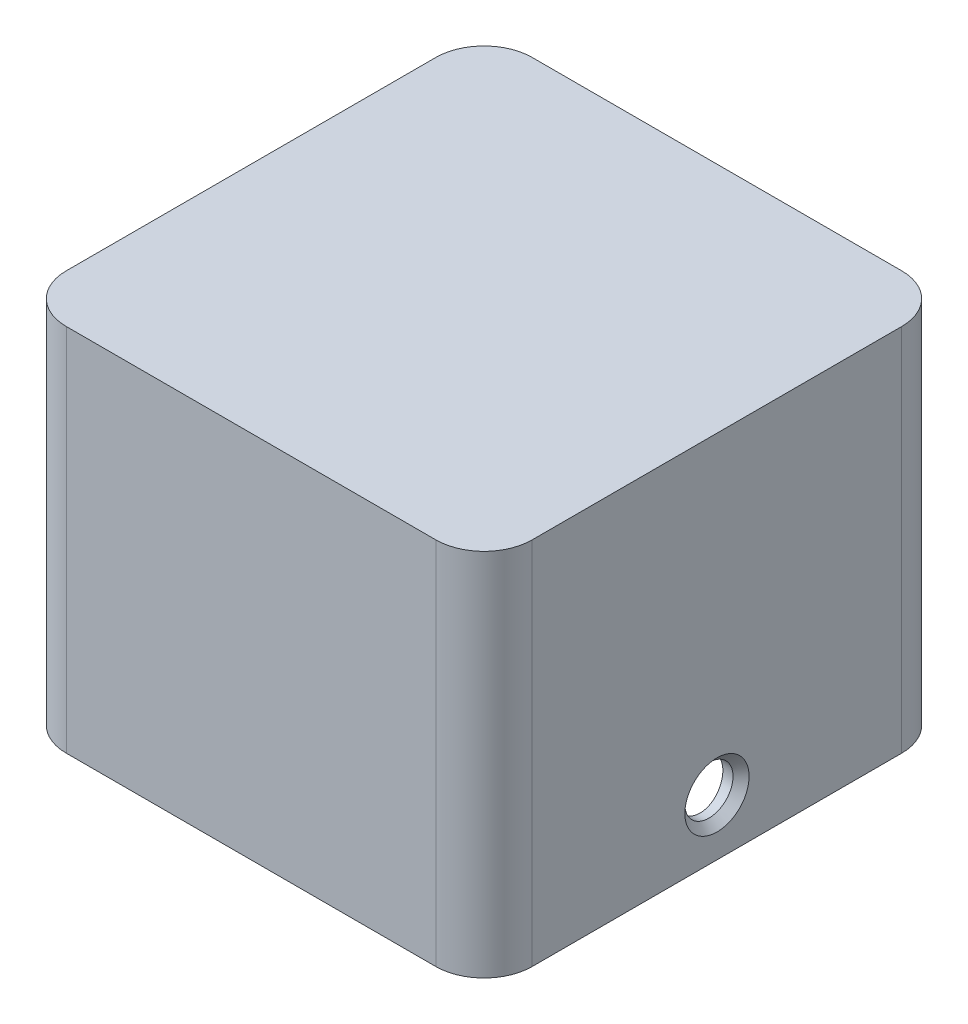
ISO-10303-21;
HEADER;
FILE_DESCRIPTION(('STEP AP214'),'2;1');
FILE_NAME('part.step','',(''),(''),'','','');
FILE_SCHEMA(('AUTOMOTIVE_DESIGN { 1 0 10303 214 1 1 1 1 }'));
ENDSEC;
DATA;
#1=APPLICATION_CONTEXT('core data for automotive mechanical design processes');
#2=APPLICATION_PROTOCOL_DEFINITION('international standard','automotive_design',2000,#1);
#3=PRODUCT_CONTEXT('',#1,'mechanical');
#4=PRODUCT('Part','Part','',(#3));
#5=PRODUCT_RELATED_PRODUCT_CATEGORY('part','',(#4));
#6=PRODUCT_DEFINITION_FORMATION('','',#4);
#7=PRODUCT_DEFINITION_CONTEXT('part definition',#1,'design');
#8=PRODUCT_DEFINITION('design','',#6,#7);
#9=PRODUCT_DEFINITION_SHAPE('','',#8);
#10=(LENGTH_UNIT() NAMED_UNIT(*) SI_UNIT(.MILLI.,.METRE.));
#11=(NAMED_UNIT(*) PLANE_ANGLE_UNIT() SI_UNIT($,.RADIAN.));
#12=(NAMED_UNIT(*) SI_UNIT($,.STERADIAN.) SOLID_ANGLE_UNIT());
#13=UNCERTAINTY_MEASURE_WITH_UNIT(LENGTH_MEASURE(1.E-05),#10,'distance_accuracy_value','');
#14=(GEOMETRIC_REPRESENTATION_CONTEXT(3) GLOBAL_UNCERTAINTY_ASSIGNED_CONTEXT((#13)) GLOBAL_UNIT_ASSIGNED_CONTEXT((#10,
#11,#12)) REPRESENTATION_CONTEXT('',''));
#15=CARTESIAN_POINT('',(0.,0.,0.));
#16=DIRECTION('',(0.,0.,1.));
#17=DIRECTION('',(1.,0.,0.));
#18=AXIS2_PLACEMENT_3D('',#15,#16,#17);
#19=CARTESIAN_POINT('',(0.,23.,0.));
#20=DIRECTION('',(1.,0.,0.));
#21=DIRECTION('',(0.,0.,-1.));
#22=AXIS2_PLACEMENT_3D('',#19,#20,#21);
#23=PLANE('',#22);
#24=CARTESIAN_POINT('',(0.,3.5,-14.5));
#25=DIRECTION('',(1.,0.,0.));
#26=DIRECTION('',(0.,0.,-1.));
#27=AXIS2_PLACEMENT_3D('',#24,#25,#26);
#28=CIRCLE('',#27,2.00000000000003);
#29=CARTESIAN_POINT('',(0.,3.5,-16.5));
#30=VERTEX_POINT('',#29);
#31=EDGE_CURVE('E11',#30,#30,#28,.T.);
#32=ORIENTED_EDGE('',*,*,#31,.T.);
#33=EDGE_LOOP('',(#32));
#34=FACE_BOUND('',#33,.T.);
#35=DIRECTION('',(0.,0.,1.));
#36=VECTOR('',#35,1.);
#37=CARTESIAN_POINT('',(0.,23.,0.));
#38=LINE('',#37,#36);
#39=CARTESIAN_POINT('',(0.,23.,-26.));
#40=VERTEX_POINT('',#39);
#41=CARTESIAN_POINT('',(0.,23.,-3.));
#42=VERTEX_POINT('',#41);
#43=EDGE_CURVE('E123',#40,#42,#38,.T.);
#44=ORIENTED_EDGE('',*,*,#43,.F.);
#45=DIRECTION('',(0.,-1.,0.));
#46=VECTOR('',#45,1.);
#47=CARTESIAN_POINT('',(0.,23.,-26.));
#48=LINE('',#47,#46);
#49=CARTESIAN_POINT('',(0.,0.,-26.));
#50=VERTEX_POINT('',#49);
#51=EDGE_CURVE('E108',#40,#50,#48,.T.);
#52=ORIENTED_EDGE('',*,*,#51,.T.);
#53=DIRECTION('',(0.,0.,1.));
#54=VECTOR('',#53,1.);
#55=CARTESIAN_POINT('',(0.,0.,0.));
#56=LINE('',#55,#54);
#57=CARTESIAN_POINT('',(0.,0.,-3.));
#58=VERTEX_POINT('',#57);
#59=EDGE_CURVE('E120',#50,#58,#56,.T.);
#60=ORIENTED_EDGE('',*,*,#59,.T.);
#61=DIRECTION('',(0.,-1.,0.));
#62=VECTOR('',#61,1.);
#63=CARTESIAN_POINT('',(0.,23.,-3.));
#64=LINE('',#63,#62);
#65=EDGE_CURVE('E125',#58,#42,#64,.F.);
#66=ORIENTED_EDGE('',*,*,#65,.T.);
#67=EDGE_LOOP('',(#44,#52,#60,#66));
#68=FACE_BOUND('',#67,.T.);
#69=ADVANCED_FACE('F36',(#34,#68),#23,.F.);
#70=CARTESIAN_POINT('',(0.,23.,0.));
#71=DIRECTION('',(0.,0.,-1.));
#72=DIRECTION('',(-1.,0.,0.));
#73=AXIS2_PLACEMENT_3D('',#70,#71,#72);
#74=PLANE('',#73);
#75=DIRECTION('',(1.,0.,0.));
#76=VECTOR('',#75,1.);
#77=CARTESIAN_POINT('',(0.,0.,0.));
#78=LINE('',#77,#76);
#79=CARTESIAN_POINT('',(3.,0.,0.));
#80=VERTEX_POINT('',#79);
#81=CARTESIAN_POINT('',(26.,0.,0.));
#82=VERTEX_POINT('',#81);
#83=EDGE_CURVE('E129',#80,#82,#78,.T.);
#84=ORIENTED_EDGE('',*,*,#83,.T.);
#85=DIRECTION('',(0.,-1.,0.));
#86=VECTOR('',#85,1.);
#87=CARTESIAN_POINT('',(26.,23.,0.));
#88=LINE('',#87,#86);
#89=CARTESIAN_POINT('',(26.,23.,0.));
#90=VERTEX_POINT('',#89);
#91=EDGE_CURVE('E167',#82,#90,#88,.F.);
#92=ORIENTED_EDGE('',*,*,#91,.T.);
#93=DIRECTION('',(1.,0.,0.));
#94=VECTOR('',#93,1.);
#95=CARTESIAN_POINT('',(0.,23.,0.));
#96=LINE('',#95,#94);
#97=CARTESIAN_POINT('',(3.,23.,0.));
#98=VERTEX_POINT('',#97);
#99=EDGE_CURVE('E305',#98,#90,#96,.T.);
#100=ORIENTED_EDGE('',*,*,#99,.F.);
#101=DIRECTION('',(0.,-1.,0.));
#102=VECTOR('',#101,1.);
#103=CARTESIAN_POINT('',(3.,23.,0.));
#104=LINE('',#103,#102);
#105=EDGE_CURVE('E164',#98,#80,#104,.T.);
#106=ORIENTED_EDGE('',*,*,#105,.T.);
#107=EDGE_LOOP('',(#84,#92,#100,#106));
#108=FACE_BOUND('',#107,.T.);
#109=ADVANCED_FACE('F243',(#108),#74,.F.);
#110=CARTESIAN_POINT('',(29.,23.,0.));
#111=DIRECTION('',(-1.,0.,0.));
#112=DIRECTION('',(0.,0.,1.));
#113=AXIS2_PLACEMENT_3D('',#110,#111,#112);
#114=PLANE('',#113);
#115=CARTESIAN_POINT('',(29.,3.5,-14.5));
#116=DIRECTION('',(-1.,0.,0.));
#117=DIRECTION('',(0.,0.,1.));
#118=AXIS2_PLACEMENT_3D('',#115,#116,#117);
#119=CIRCLE('',#118,1.99999999999998);
#120=CARTESIAN_POINT('',(29.,3.5,-12.5));
#121=VERTEX_POINT('',#120);
#122=EDGE_CURVE('E169',#121,#121,#119,.T.);
#123=ORIENTED_EDGE('',*,*,#122,.T.);
#124=EDGE_LOOP('',(#123));
#125=FACE_BOUND('',#124,.T.);
#126=DIRECTION('',(0.,0.,-1.));
#127=VECTOR('',#126,1.);
#128=CARTESIAN_POINT('',(29.,0.,0.));
#129=LINE('',#128,#127);
#130=CARTESIAN_POINT('',(29.,0.,-3.));
#131=VERTEX_POINT('',#130);
#132=CARTESIAN_POINT('',(29.,0.,-26.));
#133=VERTEX_POINT('',#132);
#134=EDGE_CURVE('E133',#131,#133,#129,.T.);
#135=ORIENTED_EDGE('',*,*,#134,.T.);
#136=DIRECTION('',(0.,-1.,0.));
#137=VECTOR('',#136,1.);
#138=CARTESIAN_POINT('',(29.,23.,-26.));
#139=LINE('',#138,#137);
#140=CARTESIAN_POINT('',(29.,23.,-26.));
#141=VERTEX_POINT('',#140);
#142=EDGE_CURVE('E52',#133,#141,#139,.F.);
#143=ORIENTED_EDGE('',*,*,#142,.T.);
#144=DIRECTION('',(0.,0.,-1.));
#145=VECTOR('',#144,1.);
#146=CARTESIAN_POINT('',(29.,23.,0.));
#147=LINE('',#146,#145);
#148=CARTESIAN_POINT('',(29.,23.,-3.));
#149=VERTEX_POINT('',#148);
#150=EDGE_CURVE('E306',#149,#141,#147,.T.);
#151=ORIENTED_EDGE('',*,*,#150,.F.);
#152=DIRECTION('',(0.,-1.,0.));
#153=VECTOR('',#152,1.);
#154=CARTESIAN_POINT('',(29.,23.,-3.));
#155=LINE('',#154,#153);
#156=EDGE_CURVE('E160',#149,#131,#155,.T.);
#157=ORIENTED_EDGE('',*,*,#156,.T.);
#158=EDGE_LOOP('',(#135,#143,#151,#157));
#159=FACE_BOUND('',#158,.T.);
#160=ADVANCED_FACE('F250',(#125,#159),#114,.F.);
#161=CARTESIAN_POINT('',(0.,23.,-29.));
#162=DIRECTION('',(0.,0.,1.));
#163=DIRECTION('',(1.,0.,0.));
#164=AXIS2_PLACEMENT_3D('',#161,#162,#163);
#165=PLANE('',#164);
#166=DIRECTION('',(-1.,0.,0.));
#167=VECTOR('',#166,1.);
#168=CARTESIAN_POINT('',(0.,0.,-29.));
#169=LINE('',#168,#167);
#170=CARTESIAN_POINT('',(26.,0.,-29.));
#171=VERTEX_POINT('',#170);
#172=CARTESIAN_POINT('',(3.,0.,-29.));
#173=VERTEX_POINT('',#172);
#174=EDGE_CURVE('E143',#171,#173,#169,.T.);
#175=ORIENTED_EDGE('',*,*,#174,.T.);
#176=DIRECTION('',(0.,-1.,0.));
#177=VECTOR('',#176,1.);
#178=CARTESIAN_POINT('',(3.,23.,-29.));
#179=LINE('',#178,#177);
#180=CARTESIAN_POINT('',(3.,23.,-29.));
#181=VERTEX_POINT('',#180);
#182=EDGE_CURVE('E109',#173,#181,#179,.F.);
#183=ORIENTED_EDGE('',*,*,#182,.T.);
#184=DIRECTION('',(-1.,0.,0.));
#185=VECTOR('',#184,1.);
#186=CARTESIAN_POINT('',(0.,23.,-29.));
#187=LINE('',#186,#185);
#188=CARTESIAN_POINT('',(26.,23.,-29.));
#189=VERTEX_POINT('',#188);
#190=EDGE_CURVE('E139',#189,#181,#187,.T.);
#191=ORIENTED_EDGE('',*,*,#190,.F.);
#192=DIRECTION('',(0.,-1.,0.));
#193=VECTOR('',#192,1.);
#194=CARTESIAN_POINT('',(26.,23.,-29.));
#195=LINE('',#194,#193);
#196=EDGE_CURVE('E114',#189,#171,#195,.T.);
#197=ORIENTED_EDGE('',*,*,#196,.T.);
#198=EDGE_LOOP('',(#175,#183,#191,#197));
#199=FACE_BOUND('',#198,.T.);
#200=ADVANCED_FACE('F313',(#199),#165,.F.);
#201=CARTESIAN_POINT('',(0.,23.,0.));
#202=DIRECTION('',(0.,-1.,0.));
#203=DIRECTION('',(0.,0.,-1.));
#204=AXIS2_PLACEMENT_3D('',#201,#202,#203);
#205=PLANE('',#204);
#206=ORIENTED_EDGE('',*,*,#190,.T.);
#207=CARTESIAN_POINT('',(3.,23.,-26.));
#208=DIRECTION('',(0.,-1.,0.));
#209=DIRECTION('',(0.,0.,-1.));
#210=AXIS2_PLACEMENT_3D('',#207,#208,#209);
#211=CIRCLE('',#210,3.);
#212=EDGE_CURVE('E158',#181,#40,#211,.F.);
#213=ORIENTED_EDGE('',*,*,#212,.T.);
#214=ORIENTED_EDGE('',*,*,#43,.T.);
#215=CARTESIAN_POINT('',(3.,23.,-3.));
#216=DIRECTION('',(0.,-1.,0.));
#217=DIRECTION('',(0.,0.,-1.));
#218=AXIS2_PLACEMENT_3D('',#215,#216,#217);
#219=CIRCLE('',#218,3.);
#220=EDGE_CURVE('E153',#42,#98,#219,.F.);
#221=ORIENTED_EDGE('',*,*,#220,.T.);
#222=ORIENTED_EDGE('',*,*,#99,.T.);
#223=CARTESIAN_POINT('',(26.,23.,-3.));
#224=DIRECTION('',(0.,-1.,0.));
#225=DIRECTION('',(0.,0.,-1.));
#226=AXIS2_PLACEMENT_3D('',#223,#224,#225);
#227=CIRCLE('',#226,3.);
#228=EDGE_CURVE('E59',#90,#149,#227,.F.);
#229=ORIENTED_EDGE('',*,*,#228,.T.);
#230=ORIENTED_EDGE('',*,*,#150,.T.);
#231=CARTESIAN_POINT('',(26.,23.,-26.));
#232=DIRECTION('',(0.,-1.,0.));
#233=DIRECTION('',(0.,0.,-1.));
#234=AXIS2_PLACEMENT_3D('',#231,#232,#233);
#235=CIRCLE('',#234,3.);
#236=EDGE_CURVE('E156',#141,#189,#235,.F.);
#237=ORIENTED_EDGE('',*,*,#236,.T.);
#238=EDGE_LOOP('',(#206,#213,#214,#221,#222,#229,#230,#237));
#239=FACE_BOUND('',#238,.T.);
#240=ADVANCED_FACE('F310',(#239),#205,.F.);
#241=CARTESIAN_POINT('',(0.,0.,0.));
#242=DIRECTION('',(0.,-1.,0.));
#243=DIRECTION('',(0.,0.,-1.));
#244=AXIS2_PLACEMENT_3D('',#241,#242,#243);
#245=PLANE('',#244);
#246=CARTESIAN_POINT('',(2.99999999999997,0.,-26.));
#247=DIRECTION('',(0.,-1.,0.));
#248=DIRECTION('',(0.,0.,1.));
#249=AXIS2_PLACEMENT_3D('',#246,#247,#248);
#250=CIRCLE('',#249,0.85);
#251=CARTESIAN_POINT('',(2.99999999999997,0.,-25.15));
#252=VERTEX_POINT('',#251);
#253=EDGE_CURVE('E471',#252,#252,#250,.T.);
#254=ORIENTED_EDGE('',*,*,#253,.F.);
#255=EDGE_LOOP('',(#254));
#256=FACE_BOUND('',#255,.T.);
#257=CARTESIAN_POINT('',(26.,0.,-26.));
#258=DIRECTION('',(0.,-1.,0.));
#259=DIRECTION('',(0.,0.,-1.));
#260=AXIS2_PLACEMENT_3D('',#257,#258,#259);
#261=CIRCLE('',#260,0.85);
#262=CARTESIAN_POINT('',(26.,0.,-26.85));
#263=VERTEX_POINT('',#262);
#264=EDGE_CURVE('E475',#263,#263,#261,.T.);
#265=ORIENTED_EDGE('',*,*,#264,.F.);
#266=EDGE_LOOP('',(#265));
#267=FACE_BOUND('',#266,.T.);
#268=CARTESIAN_POINT('',(26.,0.,-3.));
#269=DIRECTION('',(0.,-1.,0.));
#270=DIRECTION('',(0.,0.,1.));
#271=AXIS2_PLACEMENT_3D('',#268,#269,#270);
#272=CIRCLE('',#271,0.85);
#273=CARTESIAN_POINT('',(26.,0.,-2.15));
#274=VERTEX_POINT('',#273);
#275=EDGE_CURVE('E479',#274,#274,#272,.T.);
#276=ORIENTED_EDGE('',*,*,#275,.F.);
#277=EDGE_LOOP('',(#276));
#278=FACE_BOUND('',#277,.T.);
#279=CARTESIAN_POINT('',(2.99999999999999,0.,-3.));
#280=DIRECTION('',(0.,-1.,0.));
#281=DIRECTION('',(0.,0.,-1.));
#282=AXIS2_PLACEMENT_3D('',#279,#280,#281);
#283=CIRCLE('',#282,0.85);
#284=CARTESIAN_POINT('',(2.99999999999999,0.,-3.85));
#285=VERTEX_POINT('',#284);
#286=EDGE_CURVE('E482',#285,#285,#283,.T.);
#287=ORIENTED_EDGE('',*,*,#286,.F.);
#288=EDGE_LOOP('',(#287));
#289=FACE_BOUND('',#288,.T.);
#290=CARTESIAN_POINT('',(14.5,0.,-14.5));
#291=DIRECTION('',(0.,-1.,0.));
#292=DIRECTION('',(0.,0.,-1.));
#293=AXIS2_PLACEMENT_3D('',#290,#291,#292);
#294=CIRCLE('',#293,13.45);
#295=CARTESIAN_POINT('',(14.5,0.,-27.95));
#296=VERTEX_POINT('',#295);
#297=EDGE_CURVE('E136',#296,#296,#294,.T.);
#298=ORIENTED_EDGE('',*,*,#297,.F.);
#299=EDGE_LOOP('',(#298));
#300=FACE_BOUND('',#299,.T.);
#301=ORIENTED_EDGE('',*,*,#59,.F.);
#302=CARTESIAN_POINT('',(3.,0.,-26.));
#303=DIRECTION('',(0.,-1.,0.));
#304=DIRECTION('',(0.,0.,-1.));
#305=AXIS2_PLACEMENT_3D('',#302,#303,#304);
#306=CIRCLE('',#305,3.);
#307=EDGE_CURVE('E104',#50,#173,#306,.T.);
#308=ORIENTED_EDGE('',*,*,#307,.T.);
#309=ORIENTED_EDGE('',*,*,#174,.F.);
#310=CARTESIAN_POINT('',(26.,0.,-26.));
#311=DIRECTION('',(0.,-1.,0.));
#312=DIRECTION('',(0.,0.,-1.));
#313=AXIS2_PLACEMENT_3D('',#310,#311,#312);
#314=CIRCLE('',#313,3.);
#315=EDGE_CURVE('E115',#171,#133,#314,.T.);
#316=ORIENTED_EDGE('',*,*,#315,.T.);
#317=ORIENTED_EDGE('',*,*,#134,.F.);
#318=CARTESIAN_POINT('',(26.,0.,-3.));
#319=DIRECTION('',(0.,-1.,0.));
#320=DIRECTION('',(0.,0.,-1.));
#321=AXIS2_PLACEMENT_3D('',#318,#319,#320);
#322=CIRCLE('',#321,3.);
#323=EDGE_CURVE('E147',#131,#82,#322,.T.);
#324=ORIENTED_EDGE('',*,*,#323,.T.);
#325=ORIENTED_EDGE('',*,*,#83,.F.);
#326=CARTESIAN_POINT('',(3.,0.,-3.));
#327=DIRECTION('',(0.,-1.,0.));
#328=DIRECTION('',(0.,0.,-1.));
#329=AXIS2_PLACEMENT_3D('',#326,#327,#328);
#330=CIRCLE('',#329,3.);
#331=EDGE_CURVE('E124',#80,#58,#330,.T.);
#332=ORIENTED_EDGE('',*,*,#331,.T.);
#333=EDGE_LOOP('',(#301,#308,#309,#316,#317,#324,#325,#332));
#334=FACE_BOUND('',#333,.T.);
#335=ADVANCED_FACE('F127',(#256,#267,#278,#289,#300,#334),#245,.T.);
#336=CARTESIAN_POINT('',(3.,23.,-26.));
#337=DIRECTION('',(0.,-1.,0.));
#338=DIRECTION('',(0.,0.,-1.));
#339=AXIS2_PLACEMENT_3D('',#336,#337,#338);
#340=CYLINDRICAL_SURFACE('',#339,3.);
#341=ORIENTED_EDGE('',*,*,#212,.F.);
#342=ORIENTED_EDGE('',*,*,#182,.F.);
#343=ORIENTED_EDGE('',*,*,#307,.F.);
#344=ORIENTED_EDGE('',*,*,#51,.F.);
#345=EDGE_LOOP('',(#341,#342,#343,#344));
#346=FACE_BOUND('',#345,.T.);
#347=ADVANCED_FACE('F107',(#346),#340,.T.);
#348=CARTESIAN_POINT('',(26.,23.,-26.));
#349=DIRECTION('',(0.,-1.,0.));
#350=DIRECTION('',(0.,0.,-1.));
#351=AXIS2_PLACEMENT_3D('',#348,#349,#350);
#352=CYLINDRICAL_SURFACE('',#351,3.);
#353=ORIENTED_EDGE('',*,*,#236,.F.);
#354=ORIENTED_EDGE('',*,*,#142,.F.);
#355=ORIENTED_EDGE('',*,*,#315,.F.);
#356=ORIENTED_EDGE('',*,*,#196,.F.);
#357=EDGE_LOOP('',(#353,#354,#355,#356));
#358=FACE_BOUND('',#357,.T.);
#359=ADVANCED_FACE('F257',(#358),#352,.T.);
#360=CARTESIAN_POINT('',(26.,23.,-3.));
#361=DIRECTION('',(0.,-1.,0.));
#362=DIRECTION('',(0.,0.,-1.));
#363=AXIS2_PLACEMENT_3D('',#360,#361,#362);
#364=CYLINDRICAL_SURFACE('',#363,3.);
#365=ORIENTED_EDGE('',*,*,#228,.F.);
#366=ORIENTED_EDGE('',*,*,#91,.F.);
#367=ORIENTED_EDGE('',*,*,#323,.F.);
#368=ORIENTED_EDGE('',*,*,#156,.F.);
#369=EDGE_LOOP('',(#365,#366,#367,#368));
#370=FACE_BOUND('',#369,.T.);
#371=ADVANCED_FACE('F260',(#370),#364,.T.);
#372=CARTESIAN_POINT('',(3.,23.,-3.));
#373=DIRECTION('',(0.,-1.,0.));
#374=DIRECTION('',(0.,0.,-1.));
#375=AXIS2_PLACEMENT_3D('',#372,#373,#374);
#376=CYLINDRICAL_SURFACE('',#375,3.);
#377=ORIENTED_EDGE('',*,*,#220,.F.);
#378=ORIENTED_EDGE('',*,*,#65,.F.);
#379=ORIENTED_EDGE('',*,*,#331,.F.);
#380=ORIENTED_EDGE('',*,*,#105,.F.);
#381=EDGE_LOOP('',(#377,#378,#379,#380));
#382=FACE_BOUND('',#381,.T.);
#383=ADVANCED_FACE('F238',(#382),#376,.T.);
#384=CARTESIAN_POINT('',(14.5,6.75,-14.5));
#385=DIRECTION('',(0.,-1.,0.));
#386=DIRECTION('',(0.,0.,-1.));
#387=AXIS2_PLACEMENT_3D('',#384,#385,#386);
#388=CYLINDRICAL_SURFACE('',#387,13.45);
#389=CARTESIAN_POINT('',(27.8660951665024,3.5,-13.));
#390=CARTESIAN_POINT('',(27.8660962556716,3.41602591520711,-13.0000036100501));
#391=CARTESIAN_POINT('',(27.8668950681178,3.33199762222411,-13.0070754161476));
#392=CARTESIAN_POINT('',(27.8700032342052,3.16627456327549,-13.0351772613165));
#393=CARTESIAN_POINT('',(27.8723142151043,3.08458241020455,-13.0562223375072));
#394=CARTESIAN_POINT('',(27.8781817725248,2.92595531941418,-13.1116469413439));
#395=CARTESIAN_POINT('',(27.8817375546714,2.84901738452409,-13.1460179664836));
#396=CARTESIAN_POINT('',(27.8896930997676,2.70201771553143,-13.2271016178089));
#397=CARTESIAN_POINT('',(27.8940927052054,2.63195470180851,-13.273811941298));
#398=CARTESIAN_POINT('',(27.9032622764335,2.50036380999346,-13.378473006224));
#399=CARTESIAN_POINT('',(27.908033652545,2.43887117373274,-13.4364679384079));
#400=CARTESIAN_POINT('',(27.9173964069745,2.32647049147204,-13.5619571499876));
#401=CARTESIAN_POINT('',(27.9219877767424,2.27556294776426,-13.6294518799206));
#402=CARTESIAN_POINT('',(27.9304873814741,2.18565345074478,-13.7722434334907));
#403=CARTESIAN_POINT('',(27.9343937954266,2.14668303404182,-13.8475602319443));
#404=CARTESIAN_POINT('',(27.9410679186574,2.08195586653981,-14.0037197601065));
#405=CARTESIAN_POINT('',(27.9438356619622,2.05619872088766,-14.0845623246064));
#406=CARTESIAN_POINT('',(27.9479106776437,2.0187335582705,-14.2491202184332));
#407=CARTESIAN_POINT('',(27.9492240037729,2.00696729155712,-14.3328221336484));
#408=CARTESIAN_POINT('',(27.950262836992,1.99763752643912,-14.501022205433));
#409=CARTESIAN_POINT('',(27.9499883945001,2.00007357705156,-14.5855203366341));
#410=CARTESIAN_POINT('',(27.9478875420891,2.01903227480298,-14.7525184389088));
#411=CARTESIAN_POINT('',(27.9460680335036,2.03549228234181,-14.8350256202149));
#412=CARTESIAN_POINT('',(27.9410893407858,2.08193392522201,-14.99609911842));
#413=CARTESIAN_POINT('',(27.937930135677,2.11191577228384,-15.0746653735918));
#414=CARTESIAN_POINT('',(27.9306152425109,2.18461780133527,-15.2258227329515));
#415=CARTESIAN_POINT('',(27.926457410679,2.22736543664336,-15.2984005249886));
#416=CARTESIAN_POINT('',(27.9176112208746,2.32436564590732,-15.4353755008842));
#417=CARTESIAN_POINT('',(27.9129228435336,2.37861863994925,-15.4997723859024));
#418=CARTESIAN_POINT('',(27.9035109582735,2.49744118703849,-15.6189249371154));
#419=CARTESIAN_POINT('',(27.898787398021,2.56206527567696,-15.6736262290863));
#420=CARTESIAN_POINT('',(27.889862855698,2.69960724948402,-15.7714131550996));
#421=CARTESIAN_POINT('',(27.8856618747221,2.77252515202614,-15.8144987648092));
#422=CARTESIAN_POINT('',(27.8782579776847,2.92462955314788,-15.887832476574));
#423=CARTESIAN_POINT('',(27.8750553563697,3.00381789431744,-15.9180767884352));
#424=CARTESIAN_POINT('',(27.8700167583711,3.16619270153424,-15.9648241098007));
#425=CARTESIAN_POINT('',(27.8681807296285,3.24937901515406,-15.9813276427496));
#426=CARTESIAN_POINT('',(27.8660924589792,3.41690981870056,-16.0000540942826));
#427=CARTESIAN_POINT('',(27.8658317590934,3.50124568252797,-16.0023532778589));
#428=CARTESIAN_POINT('',(27.8669013251177,3.66910142726318,-15.9928064611521));
#429=CARTESIAN_POINT('',(27.8682315641763,3.7526213219187,-15.9809606996034));
#430=CARTESIAN_POINT('',(27.8723254212207,3.91624930188173,-15.943524235506));
#431=CARTESIAN_POINT('',(27.8750852387458,3.99636582684342,-15.9179699699243));
#432=CARTESIAN_POINT('',(27.8817242136658,4.1511759214391,-15.8538792207745));
#433=CARTESIAN_POINT('',(27.8856034027029,4.22586933769865,-15.8153423702112));
#434=CARTESIAN_POINT('',(27.8940644224462,4.368059449502,-15.7261908572952));
#435=CARTESIAN_POINT('',(27.8986491508274,4.43552442591199,-15.6755258846254));
#436=CARTESIAN_POINT('',(27.9079953593078,4.56102006107922,-15.5636279983157));
#437=CARTESIAN_POINT('',(27.9127568448563,4.61905042867212,-15.5023947586453));
#438=CARTESIAN_POINT('',(27.9219458047437,4.72429470589365,-15.3707666652624));
#439=CARTESIAN_POINT('',(27.9263716775964,4.77145870570593,-15.300331778213));
#440=CARTESIAN_POINT('',(27.9343671603499,4.85328717109279,-15.1524961820907));
#441=CARTESIAN_POINT('',(27.9379367844298,4.88795184365352,-15.0750955883948));
#442=CARTESIAN_POINT('',(27.9438103972672,4.94371401267998,-14.9156962733691));
#443=CARTESIAN_POINT('',(27.946117143688,4.96484108765735,-14.8337080051765));
#444=CARTESIAN_POINT('',(27.9492164720001,4.99302474746474,-14.6673206381736));
#445=CARTESIAN_POINT('',(27.9500091075699,5.00008183110813,-14.5829216249373));
#446=CARTESIAN_POINT('',(27.9499907817542,4.99991717740147,-14.4145974943264));
#447=CARTESIAN_POINT('',(27.9491884960316,4.99277269030454,-14.3306722898377));
#448=CARTESIAN_POINT('',(27.9460876342648,4.96457039506634,-14.1652226859761));
#449=CARTESIAN_POINT('',(27.9437890579076,4.94351258401346,-14.0836982871057));
#450=CARTESIAN_POINT('',(27.9379529408912,4.888104073,-13.9253692692376));
#451=CARTESIAN_POINT('',(27.93441567042,4.85375627172305,-13.8485636252609));
#452=CARTESIAN_POINT('',(27.9264953279038,4.77275084928282,-13.7017949213762));
#453=CARTESIAN_POINT('',(27.9221122542234,4.7260932043181,-13.631831874699));
#454=CARTESIAN_POINT('',(27.9129620682991,4.62150426766657,-13.5003388229468));
#455=CARTESIAN_POINT('',(27.9081930713257,4.56351541547494,-13.4388547306411));
#456=CARTESIAN_POINT('',(27.8988241587579,4.43802718190453,-13.326457991274));
#457=CARTESIAN_POINT('',(27.8942242837583,4.37052553569526,-13.2755478688519));
#458=CARTESIAN_POINT('',(27.8856992081795,4.22769292779193,-13.1856142420761));
#459=CARTESIAN_POINT('',(27.8817761440985,4.15233833545035,-13.1466280894153));
#460=CARTESIAN_POINT('',(27.8750740858902,3.99615381482368,-13.0819163712524));
#461=CARTESIAN_POINT('',(27.8722938219585,3.91533008046754,-13.0561760797602));
#462=CARTESIAN_POINT('',(27.8688820679911,3.77838763905925,-13.0249950884898));
#463=CARTESIAN_POINT('',(27.8678420348224,3.7231396618881,-13.0156350267193));
#464=CARTESIAN_POINT('',(27.8664482229491,3.61193581723235,-13.0031362964944));
#465=CARTESIAN_POINT('',(27.8660944404256,3.5559799536888,-12.999997593419));
#466=CARTESIAN_POINT('',(27.8660951665024,3.5,-13.));
#467=B_SPLINE_CURVE_WITH_KNOTS('',3,(#389,#390,#391,#392,#393,#394,#395,#396,#397,#398,#399,
#400,#401,#402,#403,#404,#405,#406,#407,#408,#409,#410,#411,#412,#413,#414,#415,#416,#417,#418,
#419,#420,#421,#422,#423,#424,#425,#426,#427,#428,#429,#430,#431,#432,#433,#434,#435,#436,#437,
#438,#439,#440,#441,#442,#443,#444,#445,#446,#447,#448,#449,#450,#451,#452,#453,#454,#455,#456,
#457,#458,#459,#460,#461,#462,#463,#464,#465,#466),.UNSPECIFIED.,.T.,.F.,(4,2,2,2,2,2,2,2,2,2,2,
2,2,2,2,2,2,2,2,2,2,2,2,2,2,2,2,2,2,2,2,2,2,2,2,2,2,2,4),(0.,0.251717794108654,
0.503706910431048,0.755535511168764,1.00731715010269,1.26010536972087,1.51290558210957,
1.76636801708078,2.01982287737524,2.27221876483798,2.52460663771978,2.77587306606575,
3.02714342879453,3.27895809786446,3.5307819628278,3.78397624288727,4.03717105333689,
4.29044054404573,4.54370038620428,4.79559925324007,5.04749386885657,5.2987222464763,
5.54995772648247,5.80225402371237,6.05455810565811,6.30799890528084,6.5614355077859,
6.81431646729545,7.06718846143729,7.31868870791811,7.57018900703013,7.82163448223285,
8.07308044361619,8.32583856630901,8.57865696829071,8.8322593959441,9.08557927049847,
9.25338376527555,9.42118732623846),.UNSPECIFIED.);
#468=CARTESIAN_POINT('',(27.8660951665024,3.5,-13.));
#469=VERTEX_POINT('',#468);
#470=EDGE_CURVE('E178',#469,#469,#467,.T.);
#471=ORIENTED_EDGE('',*,*,#470,.T.);
#472=EDGE_LOOP('',(#471));
#473=FACE_BOUND('',#472,.T.);
#474=CARTESIAN_POINT('',(1.13390483349755,3.5,-13.));
#475=CARTESIAN_POINT('',(1.13390374432836,3.58397408479289,-13.0000036100501));
#476=CARTESIAN_POINT('',(1.13310493188218,3.66800237777589,-13.0070754161476));
#477=CARTESIAN_POINT('',(1.1299967657948,3.83372543672451,-13.0351772613165));
#478=CARTESIAN_POINT('',(1.1276857848957,3.91541758979545,-13.0562223375072));
#479=CARTESIAN_POINT('',(1.12181822747522,4.07404468058582,-13.1116469413439));
#480=CARTESIAN_POINT('',(1.11826244532862,4.15098261547591,-13.1460179664836));
#481=CARTESIAN_POINT('',(1.11030690023236,4.29798228446857,-13.2271016178089));
#482=CARTESIAN_POINT('',(1.10590729479458,4.36804529819149,-13.273811941298));
#483=CARTESIAN_POINT('',(1.09673772356646,4.49963619000654,-13.378473006224));
#484=CARTESIAN_POINT('',(1.09196634745504,4.56112882626726,-13.4364679384079));
#485=CARTESIAN_POINT('',(1.08260359302551,4.67352950852796,-13.5619571499876));
#486=CARTESIAN_POINT('',(1.07801222325759,4.72443705223574,-13.6294518799206));
#487=CARTESIAN_POINT('',(1.06951261852587,4.81434654925522,-13.7722434334907));
#488=CARTESIAN_POINT('',(1.06560620457341,4.85331696595818,-13.8475602319443));
#489=CARTESIAN_POINT('',(1.0589320813426,4.91804413346019,-14.0037197601065));
#490=CARTESIAN_POINT('',(1.05616433803777,4.94380127911234,-14.0845623246064));
#491=CARTESIAN_POINT('',(1.05208932235631,4.9812664417295,-14.2491202184332));
#492=CARTESIAN_POINT('',(1.05077599622708,4.99303270844288,-14.3328221336484));
#493=CARTESIAN_POINT('',(1.04973716300802,5.00236247356088,-14.501022205433));
#494=CARTESIAN_POINT('',(1.05001160549988,4.99992642294844,-14.5855203366341));
#495=CARTESIAN_POINT('',(1.05211245791092,4.98096772519703,-14.7525184389088));
#496=CARTESIAN_POINT('',(1.05393196649641,4.96450771765819,-14.8350256202149));
#497=CARTESIAN_POINT('',(1.0589106592142,4.91806607477799,-14.99609911842));
#498=CARTESIAN_POINT('',(1.06206986432298,4.88808422771616,-15.0746653735918));
#499=CARTESIAN_POINT('',(1.06938475748908,4.81538219866473,-15.2258227329515));
#500=CARTESIAN_POINT('',(1.07354258932099,4.77263456335664,-15.2984005249886));
#501=CARTESIAN_POINT('',(1.08238877912541,4.67563435409268,-15.4353755008842));
#502=CARTESIAN_POINT('',(1.08707715646639,4.62138136005075,-15.4997723859024));
#503=CARTESIAN_POINT('',(1.09648904172654,4.50255881296151,-15.6189249371154));
#504=CARTESIAN_POINT('',(1.10121260197896,4.43793472432304,-15.6736262290863));
#505=CARTESIAN_POINT('',(1.110137144302,4.30039275051598,-15.7714131550996));
#506=CARTESIAN_POINT('',(1.11433812527791,4.22747484797386,-15.8144987648092));
#507=CARTESIAN_POINT('',(1.12174202231531,4.07537044685212,-15.887832476574));
#508=CARTESIAN_POINT('',(1.12494464363032,3.99618210568256,-15.9180767884352));
#509=CARTESIAN_POINT('',(1.12998324162889,3.83380729846576,-15.9648241098007));
#510=CARTESIAN_POINT('',(1.13181927037149,3.75062098484594,-15.9813276427496));
#511=CARTESIAN_POINT('',(1.13390754102084,3.58309018129944,-16.0000540942826));
#512=CARTESIAN_POINT('',(1.13416824090656,3.49875431747203,-16.0023532778589));
#513=CARTESIAN_POINT('',(1.13309867488227,3.33089857273682,-15.9928064611521));
#514=CARTESIAN_POINT('',(1.1317684358237,3.2473786780813,-15.9809606996034));
#515=CARTESIAN_POINT('',(1.12767457877933,3.08375069811828,-15.943524235506));
#516=CARTESIAN_POINT('',(1.12491476125416,3.00363417315658,-15.9179699699243));
#517=CARTESIAN_POINT('',(1.11827578633418,2.8488240785609,-15.8538792207745));
#518=CARTESIAN_POINT('',(1.11439659729713,2.77413066230135,-15.8153423702112));
#519=CARTESIAN_POINT('',(1.10593557755375,2.631940550498,-15.7261908572952));
#520=CARTESIAN_POINT('',(1.10135084917257,2.56447557408802,-15.6755258846254));
#521=CARTESIAN_POINT('',(1.09200464069221,2.43897993892078,-15.5636279983157));
#522=CARTESIAN_POINT('',(1.08724315514365,2.38094957132788,-15.5023947586453));
#523=CARTESIAN_POINT('',(1.0780541952563,2.27570529410635,-15.3707666652624));
#524=CARTESIAN_POINT('',(1.07362832240363,2.22854129429407,-15.300331778213));
#525=CARTESIAN_POINT('',(1.06563283965005,2.14671282890721,-15.1524961820907));
#526=CARTESIAN_POINT('',(1.06206321557018,2.11204815634648,-15.0750955883948));
#527=CARTESIAN_POINT('',(1.05618960273284,2.05628598732002,-14.9156962733691));
#528=CARTESIAN_POINT('',(1.05388285631196,2.03515891234265,-14.8337080051765));
#529=CARTESIAN_POINT('',(1.05078352799992,2.00697525253526,-14.6673206381736));
#530=CARTESIAN_POINT('',(1.04999089243011,1.99991816889187,-14.5829216249373));
#531=CARTESIAN_POINT('',(1.05000921824575,2.00008282259853,-14.4145974943264));
#532=CARTESIAN_POINT('',(1.05081150396842,2.00722730969546,-14.3306722898377));
#533=CARTESIAN_POINT('',(1.05391236573518,2.03542960493366,-14.1652226859761));
#534=CARTESIAN_POINT('',(1.0562109420924,2.05648741598655,-14.0836982871057));
#535=CARTESIAN_POINT('',(1.06204705910875,2.111895927,-13.9253692692376));
#536=CARTESIAN_POINT('',(1.06558432958,2.14624372827695,-13.8485636252609));
#537=CARTESIAN_POINT('',(1.07350467209624,2.22724915071718,-13.7017949213762));
#538=CARTESIAN_POINT('',(1.07788774577662,2.2739067956819,-13.631831874699));
#539=CARTESIAN_POINT('',(1.08703793170093,2.37849573233343,-13.5003388229468));
#540=CARTESIAN_POINT('',(1.09180692867429,2.43648458452506,-13.4388547306411));
#541=CARTESIAN_POINT('',(1.10117584124205,2.56197281809547,-13.326457991274));
#542=CARTESIAN_POINT('',(1.10577571624166,2.62947446430474,-13.2755478688519));
#543=CARTESIAN_POINT('',(1.11430079182053,2.77230707220807,-13.1856142420761));
#544=CARTESIAN_POINT('',(1.1182238559015,2.84766166454965,-13.1466280894153));
#545=CARTESIAN_POINT('',(1.12492591410976,3.00384618517632,-13.0819163712524));
#546=CARTESIAN_POINT('',(1.12770617804152,3.08466991953246,-13.0561760797602));
#547=CARTESIAN_POINT('',(1.13111793200892,3.22161236094075,-13.0249950884898));
#548=CARTESIAN_POINT('',(1.13215796517755,3.2768603381119,-13.0156350267193));
#549=CARTESIAN_POINT('',(1.13355177705086,3.38806418276765,-13.0031362964944));
#550=CARTESIAN_POINT('',(1.13390555957443,3.4440200463112,-12.999997593419));
#551=CARTESIAN_POINT('',(1.13390483349755,3.5,-13.));
#552=B_SPLINE_CURVE_WITH_KNOTS('',3,(#474,#475,#476,#477,#478,#479,#480,#481,#482,#483,#484,
#485,#486,#487,#488,#489,#490,#491,#492,#493,#494,#495,#496,#497,#498,#499,#500,#501,#502,#503,
#504,#505,#506,#507,#508,#509,#510,#511,#512,#513,#514,#515,#516,#517,#518,#519,#520,#521,#522,
#523,#524,#525,#526,#527,#528,#529,#530,#531,#532,#533,#534,#535,#536,#537,#538,#539,#540,#541,
#542,#543,#544,#545,#546,#547,#548,#549,#550,#551),.UNSPECIFIED.,.T.,.F.,(4,2,2,2,2,2,2,2,2,2,2,
2,2,2,2,2,2,2,2,2,2,2,2,2,2,2,2,2,2,2,2,2,2,2,2,2,2,2,4),(0.,0.251717794108653,
0.503706910431047,0.755535511168764,1.00731715010269,1.26010536972087,1.51290558210957,
1.76636801708078,2.01982287737524,2.27221876483799,2.52460663771978,2.77587306606575,
3.02714342879453,3.27895809786446,3.5307819628278,3.78397624288727,4.03717105333689,
4.29044054404573,4.54370038620428,4.79559925324006,5.04749386885656,5.29872224647629,
5.54995772648247,5.80225402371236,6.05455810565811,6.30799890528084,6.5614355077859,
6.81431646729545,7.06718846143729,7.3186887079181,7.57018900703013,7.82163448223285,
8.07308044361619,8.32583856630901,8.57865696829071,8.8322593959441,9.08557927049847,
9.25338376527555,9.42118732623846),.UNSPECIFIED.);
#553=CARTESIAN_POINT('',(1.13390483349755,3.5,-13.));
#554=VERTEX_POINT('',#553);
#555=EDGE_CURVE('E170',#554,#554,#552,.T.);
#556=ORIENTED_EDGE('',*,*,#555,.T.);
#557=EDGE_LOOP('',(#556));
#558=FACE_BOUND('',#557,.T.);
#559=CARTESIAN_POINT('',(14.5,6.75,-14.5));
#560=DIRECTION('',(0.,-1.,0.));
#561=DIRECTION('',(0.,0.,-1.));
#562=AXIS2_PLACEMENT_3D('',#559,#560,#561);
#563=CIRCLE('',#562,13.45);
#564=CARTESIAN_POINT('',(14.5,6.75,-27.95));
#565=VERTEX_POINT('',#564);
#566=EDGE_CURVE('E130',#565,#565,#563,.T.);
#567=ORIENTED_EDGE('',*,*,#566,.F.);
#568=EDGE_LOOP('',(#567));
#569=FACE_BOUND('',#568,.T.);
#570=ORIENTED_EDGE('',*,*,#297,.T.);
#571=EDGE_LOOP('',(#570));
#572=FACE_BOUND('',#571,.T.);
#573=ADVANCED_FACE('F183',(#473,#558,#569,#572),#388,.F.);
#574=CARTESIAN_POINT('',(14.5,6.75,-14.5));
#575=DIRECTION('',(0.,-1.,0.));
#576=DIRECTION('',(0.,0.,-1.));
#577=AXIS2_PLACEMENT_3D('',#574,#575,#576);
#578=PLANE('',#577);
#579=CARTESIAN_POINT('',(14.5,6.75,-14.5));
#580=DIRECTION('',(0.,-1.,0.));
#581=DIRECTION('',(0.,0.,-1.));
#582=AXIS2_PLACEMENT_3D('',#579,#580,#581);
#583=CIRCLE('',#582,12.85);
#584=CARTESIAN_POINT('',(14.5,6.75,-27.35));
#585=VERTEX_POINT('',#584);
#586=EDGE_CURVE('E298',#585,#585,#583,.T.);
#587=ORIENTED_EDGE('',*,*,#586,.F.);
#588=EDGE_LOOP('',(#587));
#589=FACE_BOUND('',#588,.T.);
#590=ORIENTED_EDGE('',*,*,#566,.T.);
#591=EDGE_LOOP('',(#590));
#592=FACE_BOUND('',#591,.T.);
#593=ADVANCED_FACE('F229',(#589,#592),#578,.T.);
#594=CARTESIAN_POINT('',(14.5,6.75,-14.5));
#595=DIRECTION('',(0.,-1.,0.));
#596=DIRECTION('',(0.,0.,-1.));
#597=AXIS2_PLACEMENT_3D('',#594,#595,#596);
#598=SPHERICAL_SURFACE('',#597,12.85);
#599=ORIENTED_EDGE('',*,*,#586,.T.);
#600=EDGE_LOOP('',(#599));
#601=FACE_BOUND('',#600,.T.);
#602=ADVANCED_FACE('F226',(#601),#598,.F.);
#603=CARTESIAN_POINT('',(2.99999999999999,10.,-3.));
#604=DIRECTION('',(0.,-1.,0.));
#605=DIRECTION('',(0.,0.,-1.));
#606=AXIS2_PLACEMENT_3D('',#603,#604,#605);
#607=CYLINDRICAL_SURFACE('',#606,0.85);
#608=CARTESIAN_POINT('',(2.99999999999999,10.,-3.));
#609=DIRECTION('',(0.,-1.,0.));
#610=DIRECTION('',(0.,0.,-1.));
#611=AXIS2_PLACEMENT_3D('',#608,#609,#610);
#612=CIRCLE('',#611,0.85);
#613=CARTESIAN_POINT('',(2.99999999999999,10.,-3.85));
#614=VERTEX_POINT('',#613);
#615=EDGE_CURVE('E301',#614,#614,#612,.T.);
#616=ORIENTED_EDGE('',*,*,#615,.F.);
#617=EDGE_LOOP('',(#616));
#618=FACE_BOUND('',#617,.T.);
#619=ORIENTED_EDGE('',*,*,#286,.T.);
#620=EDGE_LOOP('',(#619));
#621=FACE_BOUND('',#620,.T.);
#622=ADVANCED_FACE('F222',(#618,#621),#607,.F.);
#623=CARTESIAN_POINT('',(2.99999999999999,10.,-3.));
#624=DIRECTION('',(0.,-1.,0.));
#625=DIRECTION('',(0.,0.,-1.));
#626=AXIS2_PLACEMENT_3D('',#623,#624,#625);
#627=PLANE('',#626);
#628=ORIENTED_EDGE('',*,*,#615,.T.);
#629=EDGE_LOOP('',(#628));
#630=FACE_BOUND('',#629,.T.);
#631=ADVANCED_FACE('F203',(#630),#627,.T.);
#632=CARTESIAN_POINT('',(26.,10.,-3.));
#633=DIRECTION('',(0.,-1.,0.));
#634=DIRECTION('',(0.,0.,-1.));
#635=AXIS2_PLACEMENT_3D('',#632,#633,#634);
#636=CYLINDRICAL_SURFACE('',#635,0.85);
#637=CARTESIAN_POINT('',(26.,10.,-3.));
#638=DIRECTION('',(0.,-1.,0.));
#639=DIRECTION('',(0.,0.,1.));
#640=AXIS2_PLACEMENT_3D('',#637,#638,#639);
#641=CIRCLE('',#640,0.85);
#642=CARTESIAN_POINT('',(26.,10.,-2.15));
#643=VERTEX_POINT('',#642);
#644=EDGE_CURVE('E484',#643,#643,#641,.T.);
#645=ORIENTED_EDGE('',*,*,#644,.F.);
#646=EDGE_LOOP('',(#645));
#647=FACE_BOUND('',#646,.T.);
#648=ORIENTED_EDGE('',*,*,#275,.T.);
#649=EDGE_LOOP('',(#648));
#650=FACE_BOUND('',#649,.T.);
#651=ADVANCED_FACE('F199',(#647,#650),#636,.F.);
#652=CARTESIAN_POINT('',(26.,10.,-3.));
#653=DIRECTION('',(0.,1.,0.));
#654=DIRECTION('',(0.,0.,1.));
#655=AXIS2_PLACEMENT_3D('',#652,#653,#654);
#656=PLANE('',#655);
#657=ORIENTED_EDGE('',*,*,#644,.T.);
#658=EDGE_LOOP('',(#657));
#659=FACE_BOUND('',#658,.T.);
#660=ADVANCED_FACE('F194',(#659),#656,.F.);
#661=CARTESIAN_POINT('',(26.,10.,-26.));
#662=DIRECTION('',(0.,-1.,0.));
#663=DIRECTION('',(0.,0.,-1.));
#664=AXIS2_PLACEMENT_3D('',#661,#662,#663);
#665=CYLINDRICAL_SURFACE('',#664,0.85);
#666=CARTESIAN_POINT('',(26.,10.,-26.));
#667=DIRECTION('',(0.,-1.,0.));
#668=DIRECTION('',(0.,0.,-1.));
#669=AXIS2_PLACEMENT_3D('',#666,#667,#668);
#670=CIRCLE('',#669,0.85);
#671=CARTESIAN_POINT('',(26.,10.,-26.85));
#672=VERTEX_POINT('',#671);
#673=EDGE_CURVE('E496',#672,#672,#670,.T.);
#674=ORIENTED_EDGE('',*,*,#673,.F.);
#675=EDGE_LOOP('',(#674));
#676=FACE_BOUND('',#675,.T.);
#677=ORIENTED_EDGE('',*,*,#264,.T.);
#678=EDGE_LOOP('',(#677));
#679=FACE_BOUND('',#678,.T.);
#680=ADVANCED_FACE('F198',(#676,#679),#665,.F.);
#681=CARTESIAN_POINT('',(26.,10.,-26.));
#682=DIRECTION('',(0.,-1.,0.));
#683=DIRECTION('',(0.,0.,-1.));
#684=AXIS2_PLACEMENT_3D('',#681,#682,#683);
#685=PLANE('',#684);
#686=ORIENTED_EDGE('',*,*,#673,.T.);
#687=EDGE_LOOP('',(#686));
#688=FACE_BOUND('',#687,.T.);
#689=ADVANCED_FACE('F205',(#688),#685,.T.);
#690=CARTESIAN_POINT('',(2.99999999999997,10.,-26.));
#691=DIRECTION('',(0.,-1.,0.));
#692=DIRECTION('',(0.,0.,-1.));
#693=AXIS2_PLACEMENT_3D('',#690,#691,#692);
#694=CYLINDRICAL_SURFACE('',#693,0.85);
#695=CARTESIAN_POINT('',(2.99999999999997,10.,-26.));
#696=DIRECTION('',(0.,-1.,0.));
#697=DIRECTION('',(0.,0.,1.));
#698=AXIS2_PLACEMENT_3D('',#695,#696,#697);
#699=CIRCLE('',#698,0.85);
#700=CARTESIAN_POINT('',(2.99999999999997,10.,-25.15));
#701=VERTEX_POINT('',#700);
#702=EDGE_CURVE('E492',#701,#701,#699,.T.);
#703=ORIENTED_EDGE('',*,*,#702,.F.);
#704=EDGE_LOOP('',(#703));
#705=FACE_BOUND('',#704,.T.);
#706=ORIENTED_EDGE('',*,*,#253,.T.);
#707=EDGE_LOOP('',(#706));
#708=FACE_BOUND('',#707,.T.);
#709=ADVANCED_FACE('F208',(#705,#708),#694,.F.);
#710=CARTESIAN_POINT('',(2.99999999999997,10.,-26.));
#711=DIRECTION('',(0.,1.,0.));
#712=DIRECTION('',(0.,0.,1.));
#713=AXIS2_PLACEMENT_3D('',#710,#711,#712);
#714=PLANE('',#713);
#715=ORIENTED_EDGE('',*,*,#702,.T.);
#716=EDGE_LOOP('',(#715));
#717=FACE_BOUND('',#716,.T.);
#718=ADVANCED_FACE('F213',(#717),#714,.F.);
#719=CARTESIAN_POINT('',(29.,3.5,-14.5));
#720=DIRECTION('',(-1.,0.,0.));
#721=DIRECTION('',(0.,0.,1.));
#722=AXIS2_PLACEMENT_3D('',#719,#720,#721);
#723=CYLINDRICAL_SURFACE('',#722,1.5);
#724=CARTESIAN_POINT('',(0.500000000000021,3.5,-14.5));
#725=DIRECTION('',(1.,0.,0.));
#726=DIRECTION('',(0.,0.,-1.));
#727=AXIS2_PLACEMENT_3D('',#724,#725,#726);
#728=CIRCLE('',#727,1.5);
#729=CARTESIAN_POINT('',(0.500000000000021,3.5,-16.));
#730=VERTEX_POINT('',#729);
#731=EDGE_CURVE('E45',#730,#730,#728,.F.);
#732=ORIENTED_EDGE('',*,*,#731,.T.);
#733=EDGE_LOOP('',(#732));
#734=FACE_BOUND('',#733,.T.);
#735=ORIENTED_EDGE('',*,*,#555,.F.);
#736=EDGE_LOOP('',(#735));
#737=FACE_BOUND('',#736,.T.);
#738=ADVANCED_FACE('F192',(#734,#737),#723,.F.);
#739=CARTESIAN_POINT('',(28.5,3.5,-14.5));
#740=DIRECTION('',(-1.,0.,0.));
#741=DIRECTION('',(0.,0.,1.));
#742=AXIS2_PLACEMENT_3D('',#739,#740,#741);
#743=CIRCLE('',#742,1.5);
#744=CARTESIAN_POINT('',(28.5,3.5,-13.));
#745=VERTEX_POINT('',#744);
#746=EDGE_CURVE('E279',#745,#745,#743,.F.);
#747=ORIENTED_EDGE('',*,*,#746,.T.);
#748=EDGE_LOOP('',(#747));
#749=FACE_BOUND('',#748,.T.);
#750=ORIENTED_EDGE('',*,*,#470,.F.);
#751=EDGE_LOOP('',(#750));
#752=FACE_BOUND('',#751,.T.);
#753=ADVANCED_FACE('F187',(#749,#752),#723,.F.);
#754=CARTESIAN_POINT('',(29.,3.5,-14.5));
#755=DIRECTION('',(1.,0.,0.));
#756=DIRECTION('',(0.,0.,-1.));
#757=AXIS2_PLACEMENT_3D('',#754,#755,#756);
#758=CONICAL_SURFACE('',#757,1.99999999999998,0.785398163397446);
#759=ORIENTED_EDGE('',*,*,#746,.F.);
#760=EDGE_LOOP('',(#759));
#761=FACE_BOUND('',#760,.T.);
#762=ORIENTED_EDGE('',*,*,#122,.F.);
#763=EDGE_LOOP('',(#762));
#764=FACE_BOUND('',#763,.T.);
#765=ADVANCED_FACE('F191',(#761,#764),#758,.F.);
#766=CARTESIAN_POINT('',(0.500000000000021,3.5,-14.5));
#767=DIRECTION('',(-1.,0.,0.));
#768=DIRECTION('',(0.,0.,1.));
#769=AXIS2_PLACEMENT_3D('',#766,#767,#768);
#770=CONICAL_SURFACE('',#769,1.5,0.785398163397459);
#771=ORIENTED_EDGE('',*,*,#31,.F.);
#772=EDGE_LOOP('',(#771));
#773=FACE_BOUND('',#772,.T.);
#774=ORIENTED_EDGE('',*,*,#731,.F.);
#775=EDGE_LOOP('',(#774));
#776=FACE_BOUND('',#775,.T.);
#777=ADVANCED_FACE('F39',(#773,#776),#770,.F.);
#778=CLOSED_SHELL('',(#69,#109,#160,#200,#240,#335,#347,#359,#371,#383,#573,#593,#602,#622,#631,
#651,#660,#680,#689,#709,#718,#738,#753,#765,#777));
#779=MANIFOLD_SOLID_BREP('B2',#778);
#780=ADVANCED_BREP_SHAPE_REPRESENTATION('',(#18,#779),#14);
#781=SHAPE_DEFINITION_REPRESENTATION(#9,#780);
ENDSEC;
END-ISO-10303-21;
